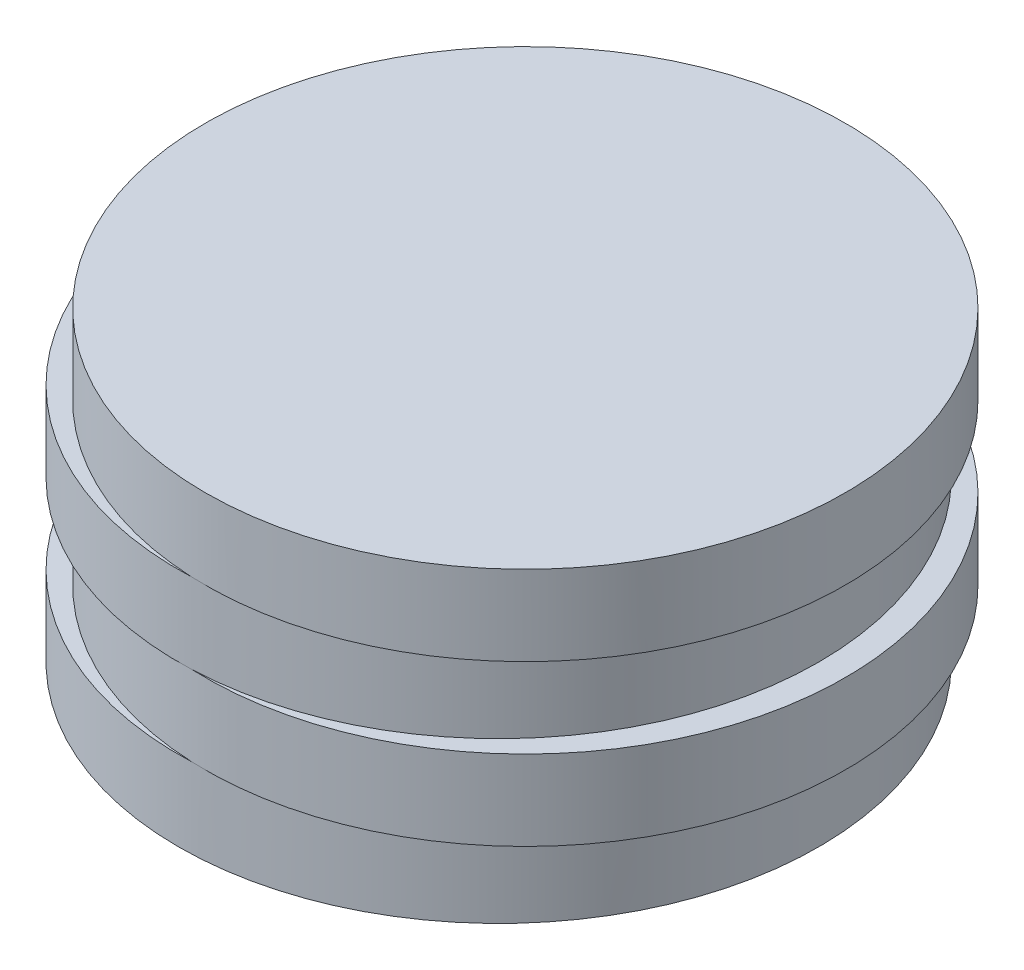
ISO-10303-21;
HEADER;
FILE_DESCRIPTION(('STEP AP214'),'2;1');
FILE_NAME('part.step','',(''),(''),'','','');
FILE_SCHEMA(('AUTOMOTIVE_DESIGN { 1 0 10303 214 1 1 1 1 }'));
ENDSEC;
DATA;
#1=APPLICATION_CONTEXT('core data for automotive mechanical design processes');
#2=APPLICATION_PROTOCOL_DEFINITION('international standard','automotive_design',2000,#1);
#3=PRODUCT_CONTEXT('',#1,'mechanical');
#4=PRODUCT('Part','Part','',(#3));
#5=PRODUCT_RELATED_PRODUCT_CATEGORY('part','',(#4));
#6=PRODUCT_DEFINITION_FORMATION('','',#4);
#7=PRODUCT_DEFINITION_CONTEXT('part definition',#1,'design');
#8=PRODUCT_DEFINITION('design','',#6,#7);
#9=PRODUCT_DEFINITION_SHAPE('','',#8);
#10=(LENGTH_UNIT() NAMED_UNIT(*) SI_UNIT(.MILLI.,.METRE.));
#11=(NAMED_UNIT(*) PLANE_ANGLE_UNIT() SI_UNIT($,.RADIAN.));
#12=(NAMED_UNIT(*) SI_UNIT($,.STERADIAN.) SOLID_ANGLE_UNIT());
#13=UNCERTAINTY_MEASURE_WITH_UNIT(LENGTH_MEASURE(1.E-05),#10,'distance_accuracy_value','');
#14=(GEOMETRIC_REPRESENTATION_CONTEXT(3) GLOBAL_UNCERTAINTY_ASSIGNED_CONTEXT((#13)) GLOBAL_UNIT_ASSIGNED_CONTEXT((#10,
#11,#12)) REPRESENTATION_CONTEXT('',''));
#15=CARTESIAN_POINT('',(0.,0.,0.));
#16=DIRECTION('',(0.,0.,1.));
#17=DIRECTION('',(1.,0.,0.));
#18=AXIS2_PLACEMENT_3D('',#15,#16,#17);
#19=CARTESIAN_POINT('',(0.,9.,0.));
#20=DIRECTION('',(0.,-1.,0.));
#21=DIRECTION('',(0.,0.,-1.));
#22=AXIS2_PLACEMENT_3D('',#19,#20,#21);
#23=CYLINDRICAL_SURFACE('',#22,36.);
#24=CARTESIAN_POINT('',(0.,9.,0.));
#25=DIRECTION('',(0.,1.,0.));
#26=DIRECTION('',(0.,0.,1.));
#27=AXIS2_PLACEMENT_3D('',#24,#25,#26);
#28=CIRCLE('',#27,36.);
#29=CARTESIAN_POINT('',(1.5,9.,35.9687364248454));
#30=VERTEX_POINT('',#29);
#31=CARTESIAN_POINT('',(1.5,9.,-35.9687364248454));
#32=VERTEX_POINT('',#31);
#33=EDGE_CURVE('E11',#30,#32,#28,.T.);
#34=ORIENTED_EDGE('',*,*,#33,.F.);
#35=EDGE_CURVE('E47',#32,#30,#28,.T.);
#36=ORIENTED_EDGE('',*,*,#35,.F.);
#37=EDGE_LOOP('',(#34,#36));
#38=FACE_BOUND('',#37,.T.);
#39=CARTESIAN_POINT('',(0.,0.,0.));
#40=DIRECTION('',(0.,1.,0.));
#41=DIRECTION('',(0.,0.,1.));
#42=AXIS2_PLACEMENT_3D('',#39,#40,#41);
#43=CIRCLE('',#42,36.);
#44=CARTESIAN_POINT('',(0.,0.,36.));
#45=VERTEX_POINT('',#44);
#46=EDGE_CURVE('E42',#45,#45,#43,.T.);
#47=ORIENTED_EDGE('',*,*,#46,.T.);
#48=EDGE_LOOP('',(#47));
#49=FACE_BOUND('',#48,.T.);
#50=ADVANCED_FACE('F39',(#38,#49),#23,.T.);
#51=CARTESIAN_POINT('',(0.,9.,0.));
#52=DIRECTION('',(0.,1.,0.));
#53=DIRECTION('',(0.,0.,1.));
#54=AXIS2_PLACEMENT_3D('',#51,#52,#53);
#55=PLANE('',#54);
#56=CARTESIAN_POINT('',(3.,9.,0.));
#57=DIRECTION('',(0.,1.,0.));
#58=DIRECTION('',(0.,0.,1.));
#59=AXIS2_PLACEMENT_3D('',#56,#57,#58);
#60=CIRCLE('',#59,36.);
#61=EDGE_CURVE('E100',#32,#30,#60,.T.);
#62=ORIENTED_EDGE('',*,*,#61,.F.);
#63=ORIENTED_EDGE('',*,*,#35,.T.);
#64=EDGE_LOOP('',(#62,#63));
#65=FACE_BOUND('',#64,.T.);
#66=ADVANCED_FACE('F113',(#65),#55,.T.);
#67=CARTESIAN_POINT('',(0.,0.,0.));
#68=DIRECTION('',(0.,1.,0.));
#69=DIRECTION('',(0.,0.,1.));
#70=AXIS2_PLACEMENT_3D('',#67,#68,#69);
#71=PLANE('',#70);
#72=ORIENTED_EDGE('',*,*,#46,.F.);
#73=EDGE_LOOP('',(#72));
#74=FACE_BOUND('',#73,.T.);
#75=ADVANCED_FACE('F117',(#74),#71,.F.);
#76=CARTESIAN_POINT('',(0.,9.,0.));
#77=DIRECTION('',(0.,1.,0.));
#78=DIRECTION('',(0.,0.,1.));
#79=AXIS2_PLACEMENT_3D('',#76,#77,#78);
#80=PLANE('',#79);
#81=EDGE_CURVE('E82',#30,#32,#60,.T.);
#82=ORIENTED_EDGE('',*,*,#81,.F.);
#83=ORIENTED_EDGE('',*,*,#33,.T.);
#84=EDGE_LOOP('',(#82,#83));
#85=FACE_BOUND('',#84,.T.);
#86=ADVANCED_FACE('F107',(#85),#80,.F.);
#87=CARTESIAN_POINT('',(3.,18.,0.));
#88=DIRECTION('',(0.,-1.,0.));
#89=DIRECTION('',(0.,0.,-1.));
#90=AXIS2_PLACEMENT_3D('',#87,#88,#89);
#91=CYLINDRICAL_SURFACE('',#90,36.);
#92=CARTESIAN_POINT('',(3.,18.,0.));
#93=DIRECTION('',(0.,1.,0.));
#94=DIRECTION('',(0.,0.,1.));
#95=AXIS2_PLACEMENT_3D('',#92,#93,#94);
#96=CIRCLE('',#95,36.);
#97=CARTESIAN_POINT('',(1.5,18.,-35.9687364248454));
#98=VERTEX_POINT('',#97);
#99=CARTESIAN_POINT('',(1.5,18.,35.9687364248454));
#100=VERTEX_POINT('',#99);
#101=EDGE_CURVE('E96',#98,#100,#96,.T.);
#102=ORIENTED_EDGE('',*,*,#101,.F.);
#103=EDGE_CURVE('E99',#100,#98,#96,.T.);
#104=ORIENTED_EDGE('',*,*,#103,.F.);
#105=EDGE_LOOP('',(#102,#104));
#106=FACE_BOUND('',#105,.T.);
#107=ORIENTED_EDGE('',*,*,#61,.T.);
#108=ORIENTED_EDGE('',*,*,#81,.T.);
#109=EDGE_LOOP('',(#107,#108));
#110=FACE_BOUND('',#109,.T.);
#111=ADVANCED_FACE('F105',(#106,#110),#91,.T.);
#112=CARTESIAN_POINT('',(0.,18.,0.));
#113=DIRECTION('',(0.,1.,0.));
#114=DIRECTION('',(0.,0.,1.));
#115=AXIS2_PLACEMENT_3D('',#112,#113,#114);
#116=PLANE('',#115);
#117=CARTESIAN_POINT('',(0.,18.,0.));
#118=DIRECTION('',(0.,1.,0.));
#119=DIRECTION('',(0.,0.,1.));
#120=AXIS2_PLACEMENT_3D('',#117,#118,#119);
#121=CIRCLE('',#120,36.);
#122=EDGE_CURVE('E60',#100,#98,#121,.T.);
#123=ORIENTED_EDGE('',*,*,#122,.F.);
#124=ORIENTED_EDGE('',*,*,#103,.T.);
#125=EDGE_LOOP('',(#123,#124));
#126=FACE_BOUND('',#125,.T.);
#127=ADVANCED_FACE('F150',(#126),#116,.T.);
#128=CARTESIAN_POINT('',(0.,18.,0.));
#129=DIRECTION('',(0.,1.,0.));
#130=DIRECTION('',(0.,0.,1.));
#131=AXIS2_PLACEMENT_3D('',#128,#129,#130);
#132=PLANE('',#131);
#133=EDGE_CURVE('E92',#98,#100,#121,.T.);
#134=ORIENTED_EDGE('',*,*,#133,.F.);
#135=ORIENTED_EDGE('',*,*,#101,.T.);
#136=EDGE_LOOP('',(#134,#135));
#137=FACE_BOUND('',#136,.T.);
#138=ADVANCED_FACE('F162',(#137),#132,.F.);
#139=CARTESIAN_POINT('',(0.,27.,0.));
#140=DIRECTION('',(0.,-1.,0.));
#141=DIRECTION('',(0.,0.,-1.));
#142=AXIS2_PLACEMENT_3D('',#139,#140,#141);
#143=CYLINDRICAL_SURFACE('',#142,36.);
#144=CARTESIAN_POINT('',(0.,27.,0.));
#145=DIRECTION('',(0.,1.,0.));
#146=DIRECTION('',(0.,0.,1.));
#147=AXIS2_PLACEMENT_3D('',#144,#145,#146);
#148=CIRCLE('',#147,36.);
#149=CARTESIAN_POINT('',(1.5,27.,35.9687364248454));
#150=VERTEX_POINT('',#149);
#151=CARTESIAN_POINT('',(1.5,27.,-35.9687364248454));
#152=VERTEX_POINT('',#151);
#153=EDGE_CURVE('E75',#150,#152,#148,.T.);
#154=ORIENTED_EDGE('',*,*,#153,.F.);
#155=EDGE_CURVE('E78',#152,#150,#148,.T.);
#156=ORIENTED_EDGE('',*,*,#155,.F.);
#157=EDGE_LOOP('',(#154,#156));
#158=FACE_BOUND('',#157,.T.);
#159=ORIENTED_EDGE('',*,*,#122,.T.);
#160=ORIENTED_EDGE('',*,*,#133,.T.);
#161=EDGE_LOOP('',(#159,#160));
#162=FACE_BOUND('',#161,.T.);
#163=ADVANCED_FACE('F76',(#158,#162),#143,.T.);
#164=CARTESIAN_POINT('',(0.,27.,0.));
#165=DIRECTION('',(0.,1.,0.));
#166=DIRECTION('',(0.,0.,1.));
#167=AXIS2_PLACEMENT_3D('',#164,#165,#166);
#168=PLANE('',#167);
#169=CARTESIAN_POINT('',(3.,27.,0.));
#170=DIRECTION('',(0.,1.,0.));
#171=DIRECTION('',(0.,0.,1.));
#172=AXIS2_PLACEMENT_3D('',#169,#170,#171);
#173=CIRCLE('',#172,36.);
#174=EDGE_CURVE('E53',#152,#150,#173,.T.);
#175=ORIENTED_EDGE('',*,*,#174,.F.);
#176=ORIENTED_EDGE('',*,*,#155,.T.);
#177=EDGE_LOOP('',(#175,#176));
#178=FACE_BOUND('',#177,.T.);
#179=ADVANCED_FACE('F84',(#178),#168,.T.);
#180=CARTESIAN_POINT('',(0.,27.,0.));
#181=DIRECTION('',(0.,1.,0.));
#182=DIRECTION('',(0.,0.,1.));
#183=AXIS2_PLACEMENT_3D('',#180,#181,#182);
#184=PLANE('',#183);
#185=EDGE_CURVE('E85',#150,#152,#173,.T.);
#186=ORIENTED_EDGE('',*,*,#185,.F.);
#187=ORIENTED_EDGE('',*,*,#153,.T.);
#188=EDGE_LOOP('',(#186,#187));
#189=FACE_BOUND('',#188,.T.);
#190=ADVANCED_FACE('F86',(#189),#184,.F.);
#191=CARTESIAN_POINT('',(3.,36.,0.));
#192=DIRECTION('',(0.,-1.,0.));
#193=DIRECTION('',(0.,0.,-1.));
#194=AXIS2_PLACEMENT_3D('',#191,#192,#193);
#195=CYLINDRICAL_SURFACE('',#194,36.);
#196=CARTESIAN_POINT('',(3.,36.,0.));
#197=DIRECTION('',(0.,1.,0.));
#198=DIRECTION('',(0.,0.,1.));
#199=AXIS2_PLACEMENT_3D('',#196,#197,#198);
#200=CIRCLE('',#199,36.);
#201=CARTESIAN_POINT('',(3.,36.,36.));
#202=VERTEX_POINT('',#201);
#203=EDGE_CURVE('E90',#202,#202,#200,.T.);
#204=ORIENTED_EDGE('',*,*,#203,.F.);
#205=EDGE_LOOP('',(#204));
#206=FACE_BOUND('',#205,.T.);
#207=ORIENTED_EDGE('',*,*,#174,.T.);
#208=ORIENTED_EDGE('',*,*,#185,.T.);
#209=EDGE_LOOP('',(#207,#208));
#210=FACE_BOUND('',#209,.T.);
#211=ADVANCED_FACE('F89',(#206,#210),#195,.T.);
#212=CARTESIAN_POINT('',(0.,36.,0.));
#213=DIRECTION('',(0.,1.,0.));
#214=DIRECTION('',(0.,0.,1.));
#215=AXIS2_PLACEMENT_3D('',#212,#213,#214);
#216=PLANE('',#215);
#217=ORIENTED_EDGE('',*,*,#203,.T.);
#218=EDGE_LOOP('',(#217));
#219=FACE_BOUND('',#218,.T.);
#220=ADVANCED_FACE('F208',(#219),#216,.T.);
#221=CLOSED_SHELL('',(#50,#66,#75,#86,#111,#127,#138,#163,#179,#190,#211,#220));
#222=MANIFOLD_SOLID_BREP('B2',#221);
#223=ADVANCED_BREP_SHAPE_REPRESENTATION('',(#18,#222),#14);
#224=SHAPE_DEFINITION_REPRESENTATION(#9,#223);
ENDSEC;
END-ISO-10303-21;
